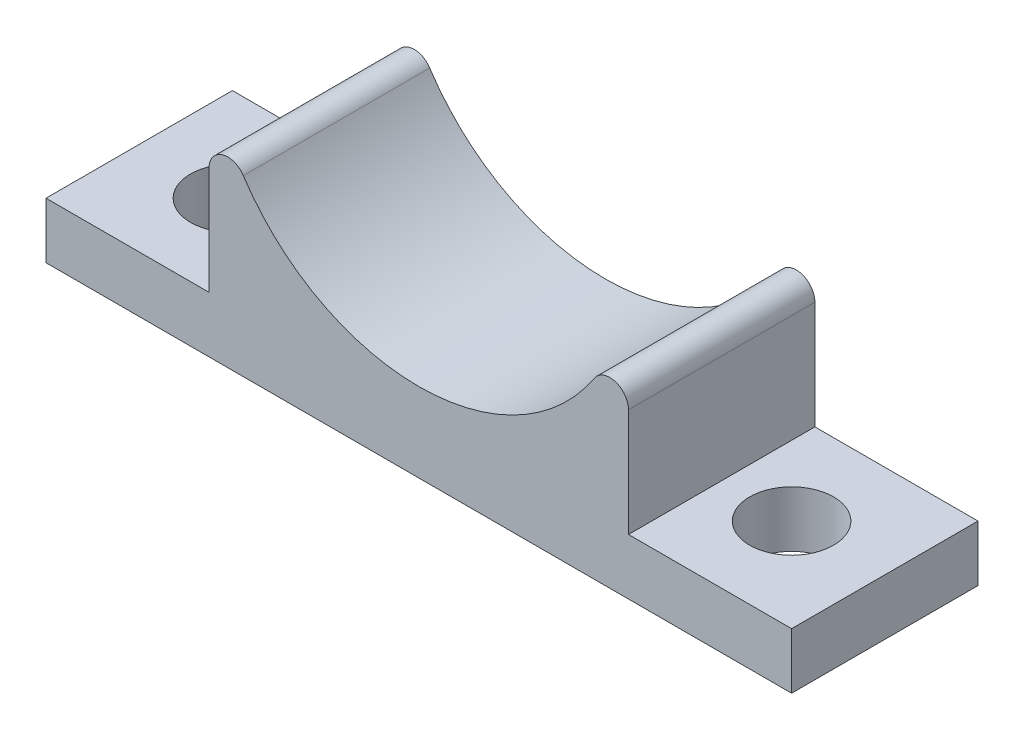
ISO-10303-21;
HEADER;
FILE_DESCRIPTION(('STEP AP214'),'2;1');
FILE_NAME('part.step','',(''),(''),'','','');
FILE_SCHEMA(('AUTOMOTIVE_DESIGN { 1 0 10303 214 1 1 1 1 }'));
ENDSEC;
DATA;
#1=APPLICATION_CONTEXT('core data for automotive mechanical design processes');
#2=APPLICATION_PROTOCOL_DEFINITION('international standard','automotive_design',2000,#1);
#3=PRODUCT_CONTEXT('',#1,'mechanical');
#4=PRODUCT('Part','Part','',(#3));
#5=PRODUCT_RELATED_PRODUCT_CATEGORY('part','',(#4));
#6=PRODUCT_DEFINITION_FORMATION('','',#4);
#7=PRODUCT_DEFINITION_CONTEXT('part definition',#1,'design');
#8=PRODUCT_DEFINITION('design','',#6,#7);
#9=PRODUCT_DEFINITION_SHAPE('','',#8);
#10=(LENGTH_UNIT() NAMED_UNIT(*) SI_UNIT(.MILLI.,.METRE.));
#11=(NAMED_UNIT(*) PLANE_ANGLE_UNIT() SI_UNIT($,.RADIAN.));
#12=(NAMED_UNIT(*) SI_UNIT($,.STERADIAN.) SOLID_ANGLE_UNIT());
#13=UNCERTAINTY_MEASURE_WITH_UNIT(LENGTH_MEASURE(1.E-05),#10,'distance_accuracy_value','');
#14=(GEOMETRIC_REPRESENTATION_CONTEXT(3) GLOBAL_UNCERTAINTY_ASSIGNED_CONTEXT((#13)) GLOBAL_UNIT_ASSIGNED_CONTEXT((#10,
#11,#12)) REPRESENTATION_CONTEXT('',''));
#15=CARTESIAN_POINT('',(0.,0.,0.));
#16=DIRECTION('',(0.,0.,1.));
#17=DIRECTION('',(1.,0.,0.));
#18=AXIS2_PLACEMENT_3D('',#15,#16,#17);
#19=CARTESIAN_POINT('',(0.,3.,0.));
#20=DIRECTION('',(0.,-1.,0.));
#21=DIRECTION('',(0.,0.,-1.));
#22=AXIS2_PLACEMENT_3D('',#19,#20,#21);
#23=PLANE('',#22);
#24=CARTESIAN_POINT('',(15.,3.,0.));
#25=DIRECTION('',(0.,-1.,0.));
#26=DIRECTION('',(0.,0.,-1.));
#27=AXIS2_PLACEMENT_3D('',#24,#25,#26);
#28=CIRCLE('',#27,2.25);
#29=CARTESIAN_POINT('',(15.,3.,-2.25));
#30=VERTEX_POINT('',#29);
#31=EDGE_CURVE('E339',#30,#30,#28,.T.);
#32=ORIENTED_EDGE('',*,*,#31,.T.);
#33=EDGE_LOOP('',(#32));
#34=FACE_BOUND('',#33,.T.);
#35=DIRECTION('',(0.,0.,-1.));
#36=VECTOR('',#35,1.);
#37=CARTESIAN_POINT('',(11.25,3.,5.));
#38=LINE('',#37,#36);
#39=CARTESIAN_POINT('',(11.25,3.,5.));
#40=VERTEX_POINT('',#39);
#41=CARTESIAN_POINT('',(11.25,3.,-5.));
#42=VERTEX_POINT('',#41);
#43=EDGE_CURVE('E114',#40,#42,#38,.T.);
#44=ORIENTED_EDGE('',*,*,#43,.F.);
#45=DIRECTION('',(1.,0.,0.));
#46=VECTOR('',#45,1.);
#47=CARTESIAN_POINT('',(-20.,3.,5.));
#48=LINE('',#47,#46);
#49=CARTESIAN_POINT('',(20.,3.,5.));
#50=VERTEX_POINT('',#49);
#51=EDGE_CURVE('E150',#40,#50,#48,.T.);
#52=ORIENTED_EDGE('',*,*,#51,.T.);
#53=DIRECTION('',(0.,0.,-1.));
#54=VECTOR('',#53,1.);
#55=CARTESIAN_POINT('',(20.,3.,5.));
#56=LINE('',#55,#54);
#57=CARTESIAN_POINT('',(20.,3.,-5.));
#58=VERTEX_POINT('',#57);
#59=EDGE_CURVE('E117',#50,#58,#56,.T.);
#60=ORIENTED_EDGE('',*,*,#59,.T.);
#61=DIRECTION('',(-1.,0.,0.));
#62=VECTOR('',#61,1.);
#63=CARTESIAN_POINT('',(-20.,3.,-5.));
#64=LINE('',#63,#62);
#65=EDGE_CURVE('E112',#58,#42,#64,.T.);
#66=ORIENTED_EDGE('',*,*,#65,.T.);
#67=EDGE_LOOP('',(#44,#52,#60,#66));
#68=FACE_BOUND('',#67,.T.);
#69=ADVANCED_FACE('F33',(#34,#68),#23,.F.);
#70=CARTESIAN_POINT('',(20.,3.,5.));
#71=DIRECTION('',(-1.,0.,0.));
#72=DIRECTION('',(0.,0.,1.));
#73=AXIS2_PLACEMENT_3D('',#70,#71,#72);
#74=PLANE('',#73);
#75=DIRECTION('',(0.,0.,-1.));
#76=VECTOR('',#75,1.);
#77=CARTESIAN_POINT('',(20.,0.,5.));
#78=LINE('',#77,#76);
#79=CARTESIAN_POINT('',(20.,0.,5.));
#80=VERTEX_POINT('',#79);
#81=CARTESIAN_POINT('',(20.,0.,-5.));
#82=VERTEX_POINT('',#81);
#83=EDGE_CURVE('E146',#80,#82,#78,.T.);
#84=ORIENTED_EDGE('',*,*,#83,.T.);
#85=DIRECTION('',(0.,-1.,0.));
#86=VECTOR('',#85,1.);
#87=CARTESIAN_POINT('',(20.,3.,-5.));
#88=LINE('',#87,#86);
#89=EDGE_CURVE('E170',#58,#82,#88,.T.);
#90=ORIENTED_EDGE('',*,*,#89,.F.);
#91=ORIENTED_EDGE('',*,*,#59,.F.);
#92=DIRECTION('',(0.,-1.,0.));
#93=VECTOR('',#92,1.);
#94=CARTESIAN_POINT('',(20.,3.,5.));
#95=LINE('',#94,#93);
#96=EDGE_CURVE('E154',#50,#80,#95,.T.);
#97=ORIENTED_EDGE('',*,*,#96,.T.);
#98=EDGE_LOOP('',(#84,#90,#91,#97));
#99=FACE_BOUND('',#98,.T.);
#100=ADVANCED_FACE('F202',(#99),#74,.F.);
#101=CARTESIAN_POINT('',(-20.,3.,-5.));
#102=DIRECTION('',(0.,0.,1.));
#103=DIRECTION('',(1.,0.,0.));
#104=AXIS2_PLACEMENT_3D('',#101,#102,#103);
#105=PLANE('',#104);
#106=CARTESIAN_POINT('',(0.,15.5,-5.));
#107=DIRECTION('',(0.,0.,-1.));
#108=DIRECTION('',(1.,0.,0.));
#109=AXIS2_PLACEMENT_3D('',#106,#107,#108);
#110=CIRCLE('',#109,11.25);
#111=CARTESIAN_POINT('',(9.41326530612245,9.33940455178629,-5.));
#112=VERTEX_POINT('',#111);
#113=CARTESIAN_POINT('',(-9.41326530612245,9.33940455178629,-5.));
#114=VERTEX_POINT('',#113);
#115=EDGE_CURVE('E138',#112,#114,#110,.T.);
#116=ORIENTED_EDGE('',*,*,#115,.F.);
#117=CARTESIAN_POINT('',(10.25,8.79179606750063,-5.));
#118=DIRECTION('',(0.,0.,1.));
#119=DIRECTION('',(1.,0.,0.));
#120=AXIS2_PLACEMENT_3D('',#117,#118,#119);
#121=CIRCLE('',#120,1.);
#122=CARTESIAN_POINT('',(11.25,8.79179606750063,-5.));
#123=VERTEX_POINT('',#122);
#124=EDGE_CURVE('E132',#112,#123,#121,.F.);
#125=ORIENTED_EDGE('',*,*,#124,.T.);
#126=DIRECTION('',(0.,1.,0.));
#127=VECTOR('',#126,1.);
#128=CARTESIAN_POINT('',(11.25,15.5,-5.));
#129=LINE('',#128,#127);
#130=EDGE_CURVE('E126',#42,#123,#129,.T.);
#131=ORIENTED_EDGE('',*,*,#130,.F.);
#132=ORIENTED_EDGE('',*,*,#65,.F.);
#133=ORIENTED_EDGE('',*,*,#89,.T.);
#134=DIRECTION('',(-1.,0.,0.));
#135=VECTOR('',#134,1.);
#136=CARTESIAN_POINT('',(-20.,0.,-5.));
#137=LINE('',#136,#135);
#138=CARTESIAN_POINT('',(-20.,0.,-5.));
#139=VERTEX_POINT('',#138);
#140=EDGE_CURVE('E157',#82,#139,#137,.T.);
#141=ORIENTED_EDGE('',*,*,#140,.T.);
#142=DIRECTION('',(0.,-1.,0.));
#143=VECTOR('',#142,1.);
#144=CARTESIAN_POINT('',(-20.,3.,-5.));
#145=LINE('',#144,#143);
#146=CARTESIAN_POINT('',(-20.,3.,-5.));
#147=VERTEX_POINT('',#146);
#148=EDGE_CURVE('E167',#147,#139,#145,.T.);
#149=ORIENTED_EDGE('',*,*,#148,.F.);
#150=CARTESIAN_POINT('',(-11.25,3.,-5.));
#151=VERTEX_POINT('',#150);
#152=EDGE_CURVE('E123',#151,#147,#64,.T.);
#153=ORIENTED_EDGE('',*,*,#152,.F.);
#154=DIRECTION('',(0.,-1.,0.));
#155=VECTOR('',#154,1.);
#156=CARTESIAN_POINT('',(-11.25,15.5,-5.));
#157=LINE('',#156,#155);
#158=CARTESIAN_POINT('',(-11.25,8.79179606750063,-5.));
#159=VERTEX_POINT('',#158);
#160=EDGE_CURVE('E134',#159,#151,#157,.T.);
#161=ORIENTED_EDGE('',*,*,#160,.F.);
#162=CARTESIAN_POINT('',(-10.25,8.79179606750063,-5.));
#163=DIRECTION('',(0.,0.,1.));
#164=DIRECTION('',(1.,0.,0.));
#165=AXIS2_PLACEMENT_3D('',#162,#163,#164);
#166=CIRCLE('',#165,1.);
#167=EDGE_CURVE('E177',#159,#114,#166,.F.);
#168=ORIENTED_EDGE('',*,*,#167,.T.);
#169=EDGE_LOOP('',(#116,#125,#131,#132,#133,#141,#149,#153,#161,#168));
#170=FACE_BOUND('',#169,.T.);
#171=ADVANCED_FACE('F131',(#170),#105,.F.);
#172=CARTESIAN_POINT('',(-20.,3.,5.));
#173=DIRECTION('',(1.,0.,0.));
#174=DIRECTION('',(0.,0.,-1.));
#175=AXIS2_PLACEMENT_3D('',#172,#173,#174);
#176=PLANE('',#175);
#177=DIRECTION('',(0.,0.,1.));
#178=VECTOR('',#177,1.);
#179=CARTESIAN_POINT('',(-20.,0.,5.));
#180=LINE('',#179,#178);
#181=CARTESIAN_POINT('',(-20.,0.,5.));
#182=VERTEX_POINT('',#181);
#183=EDGE_CURVE('E159',#139,#182,#180,.T.);
#184=ORIENTED_EDGE('',*,*,#183,.T.);
#185=DIRECTION('',(0.,-1.,0.));
#186=VECTOR('',#185,1.);
#187=CARTESIAN_POINT('',(-20.,3.,5.));
#188=LINE('',#187,#186);
#189=CARTESIAN_POINT('',(-20.,3.,5.));
#190=VERTEX_POINT('',#189);
#191=EDGE_CURVE('E164',#190,#182,#188,.T.);
#192=ORIENTED_EDGE('',*,*,#191,.F.);
#193=DIRECTION('',(0.,0.,1.));
#194=VECTOR('',#193,1.);
#195=CARTESIAN_POINT('',(-20.,3.,5.));
#196=LINE('',#195,#194);
#197=EDGE_CURVE('E122',#147,#190,#196,.T.);
#198=ORIENTED_EDGE('',*,*,#197,.F.);
#199=ORIENTED_EDGE('',*,*,#148,.T.);
#200=EDGE_LOOP('',(#184,#192,#198,#199));
#201=FACE_BOUND('',#200,.T.);
#202=ADVANCED_FACE('F221',(#201),#176,.F.);
#203=CARTESIAN_POINT('',(-20.,3.,5.));
#204=DIRECTION('',(0.,0.,-1.));
#205=DIRECTION('',(-1.,0.,0.));
#206=AXIS2_PLACEMENT_3D('',#203,#204,#205);
#207=PLANE('',#206);
#208=DIRECTION('',(0.,1.,0.));
#209=VECTOR('',#208,1.);
#210=CARTESIAN_POINT('',(11.25,15.5,5.));
#211=LINE('',#210,#209);
#212=CARTESIAN_POINT('',(11.25,8.79179606750063,5.));
#213=VERTEX_POINT('',#212);
#214=EDGE_CURVE('E127',#40,#213,#211,.T.);
#215=ORIENTED_EDGE('',*,*,#214,.T.);
#216=CARTESIAN_POINT('',(10.25,8.79179606750063,5.));
#217=DIRECTION('',(0.,0.,-1.));
#218=DIRECTION('',(-1.,0.,0.));
#219=AXIS2_PLACEMENT_3D('',#216,#217,#218);
#220=CIRCLE('',#219,1.);
#221=CARTESIAN_POINT('',(9.41326530612245,9.33940455178629,5.));
#222=VERTEX_POINT('',#221);
#223=EDGE_CURVE('E41',#213,#222,#220,.F.);
#224=ORIENTED_EDGE('',*,*,#223,.T.);
#225=CARTESIAN_POINT('',(0.,15.5,5.));
#226=DIRECTION('',(0.,0.,-1.));
#227=DIRECTION('',(1.,0.,0.));
#228=AXIS2_PLACEMENT_3D('',#225,#226,#227);
#229=CIRCLE('',#228,11.25);
#230=CARTESIAN_POINT('',(-9.41326530612245,9.33940455178629,5.));
#231=VERTEX_POINT('',#230);
#232=EDGE_CURVE('E133',#222,#231,#229,.T.);
#233=ORIENTED_EDGE('',*,*,#232,.T.);
#234=CARTESIAN_POINT('',(-10.25,8.79179606750063,5.));
#235=DIRECTION('',(0.,0.,-1.));
#236=DIRECTION('',(-1.,0.,0.));
#237=AXIS2_PLACEMENT_3D('',#234,#235,#236);
#238=CIRCLE('',#237,1.);
#239=CARTESIAN_POINT('',(-11.25,8.79179606750063,5.));
#240=VERTEX_POINT('',#239);
#241=EDGE_CURVE('E48',#231,#240,#238,.F.);
#242=ORIENTED_EDGE('',*,*,#241,.T.);
#243=DIRECTION('',(0.,-1.,0.));
#244=VECTOR('',#243,1.);
#245=CARTESIAN_POINT('',(-11.25,15.5,5.));
#246=LINE('',#245,#244);
#247=CARTESIAN_POINT('',(-11.25,3.,5.));
#248=VERTEX_POINT('',#247);
#249=EDGE_CURVE('E136',#240,#248,#246,.T.);
#250=ORIENTED_EDGE('',*,*,#249,.T.);
#251=EDGE_CURVE('E151',#190,#248,#48,.T.);
#252=ORIENTED_EDGE('',*,*,#251,.F.);
#253=ORIENTED_EDGE('',*,*,#191,.T.);
#254=DIRECTION('',(1.,0.,0.));
#255=VECTOR('',#254,1.);
#256=CARTESIAN_POINT('',(-20.,0.,5.));
#257=LINE('',#256,#255);
#258=EDGE_CURVE('E147',#182,#80,#257,.T.);
#259=ORIENTED_EDGE('',*,*,#258,.T.);
#260=ORIENTED_EDGE('',*,*,#96,.F.);
#261=ORIENTED_EDGE('',*,*,#51,.F.);
#262=EDGE_LOOP('',(#215,#224,#233,#242,#250,#252,#253,#259,#260,#261));
#263=FACE_BOUND('',#262,.T.);
#264=ADVANCED_FACE('F183',(#263),#207,.F.);
#265=CARTESIAN_POINT('',(-15.,3.,0.));
#266=DIRECTION('',(0.,-1.,0.));
#267=DIRECTION('',(0.,0.,-1.));
#268=AXIS2_PLACEMENT_3D('',#265,#266,#267);
#269=CIRCLE('',#268,2.25);
#270=CARTESIAN_POINT('',(-15.,3.,-2.25));
#271=VERTEX_POINT('',#270);
#272=EDGE_CURVE('E226',#271,#271,#269,.T.);
#273=ORIENTED_EDGE('',*,*,#272,.T.);
#274=EDGE_LOOP('',(#273));
#275=FACE_BOUND('',#274,.T.);
#276=ORIENTED_EDGE('',*,*,#251,.T.);
#277=DIRECTION('',(0.,0.,-1.));
#278=VECTOR('',#277,1.);
#279=CARTESIAN_POINT('',(-11.25,3.,5.));
#280=LINE('',#279,#278);
#281=EDGE_CURVE('E128',#248,#151,#280,.T.);
#282=ORIENTED_EDGE('',*,*,#281,.T.);
#283=ORIENTED_EDGE('',*,*,#152,.T.);
#284=ORIENTED_EDGE('',*,*,#197,.T.);
#285=EDGE_LOOP('',(#276,#282,#283,#284));
#286=FACE_BOUND('',#285,.T.);
#287=ADVANCED_FACE('F205',(#275,#286),#23,.F.);
#288=CARTESIAN_POINT('',(0.,0.,0.));
#289=DIRECTION('',(0.,-1.,0.));
#290=DIRECTION('',(0.,0.,-1.));
#291=AXIS2_PLACEMENT_3D('',#288,#289,#290);
#292=PLANE('',#291);
#293=CARTESIAN_POINT('',(-15.,0.,0.));
#294=DIRECTION('',(0.,-1.,0.));
#295=DIRECTION('',(0.,0.,-1.));
#296=AXIS2_PLACEMENT_3D('',#293,#294,#295);
#297=CIRCLE('',#296,2.25);
#298=CARTESIAN_POINT('',(-15.,0.,-2.25));
#299=VERTEX_POINT('',#298);
#300=EDGE_CURVE('E335',#299,#299,#297,.T.);
#301=ORIENTED_EDGE('',*,*,#300,.F.);
#302=EDGE_LOOP('',(#301));
#303=FACE_BOUND('',#302,.T.);
#304=CARTESIAN_POINT('',(15.,0.,0.));
#305=DIRECTION('',(0.,-1.,0.));
#306=DIRECTION('',(0.,0.,-1.));
#307=AXIS2_PLACEMENT_3D('',#304,#305,#306);
#308=CIRCLE('',#307,2.25);
#309=CARTESIAN_POINT('',(15.,0.,-2.25));
#310=VERTEX_POINT('',#309);
#311=EDGE_CURVE('E336',#310,#310,#308,.T.);
#312=ORIENTED_EDGE('',*,*,#311,.F.);
#313=EDGE_LOOP('',(#312));
#314=FACE_BOUND('',#313,.T.);
#315=ORIENTED_EDGE('',*,*,#83,.F.);
#316=ORIENTED_EDGE('',*,*,#258,.F.);
#317=ORIENTED_EDGE('',*,*,#183,.F.);
#318=ORIENTED_EDGE('',*,*,#140,.F.);
#319=EDGE_LOOP('',(#315,#316,#317,#318));
#320=FACE_BOUND('',#319,.T.);
#321=ADVANCED_FACE('F214',(#303,#314,#320),#292,.T.);
#322=CARTESIAN_POINT('',(0.,15.5,5.));
#323=DIRECTION('',(0.,0.,-1.));
#324=DIRECTION('',(-1.,0.,0.));
#325=AXIS2_PLACEMENT_3D('',#322,#323,#324);
#326=CYLINDRICAL_SURFACE('',#325,11.25);
#327=ORIENTED_EDGE('',*,*,#232,.F.);
#328=DIRECTION('',(0.,0.,-1.));
#329=VECTOR('',#328,1.);
#330=CARTESIAN_POINT('',(9.41326530612245,9.33940455178629,5.));
#331=LINE('',#330,#329);
#332=EDGE_CURVE('E174',#222,#112,#331,.T.);
#333=ORIENTED_EDGE('',*,*,#332,.T.);
#334=ORIENTED_EDGE('',*,*,#115,.T.);
#335=DIRECTION('',(0.,0.,-1.));
#336=VECTOR('',#335,1.);
#337=CARTESIAN_POINT('',(-9.41326530612245,9.33940455178629,5.));
#338=LINE('',#337,#336);
#339=EDGE_CURVE('E172',#114,#231,#338,.F.);
#340=ORIENTED_EDGE('',*,*,#339,.T.);
#341=EDGE_LOOP('',(#327,#333,#334,#340));
#342=FACE_BOUND('',#341,.T.);
#343=ADVANCED_FACE('F187',(#342),#326,.F.);
#344=CARTESIAN_POINT('',(-11.25,15.5,5.));
#345=DIRECTION('',(1.,0.,0.));
#346=DIRECTION('',(0.,0.,-1.));
#347=AXIS2_PLACEMENT_3D('',#344,#345,#346);
#348=PLANE('',#347);
#349=ORIENTED_EDGE('',*,*,#249,.F.);
#350=DIRECTION('',(0.,0.,-1.));
#351=VECTOR('',#350,1.);
#352=CARTESIAN_POINT('',(-11.25,8.79179606750063,5.));
#353=LINE('',#352,#351);
#354=EDGE_CURVE('E11',#240,#159,#353,.T.);
#355=ORIENTED_EDGE('',*,*,#354,.T.);
#356=ORIENTED_EDGE('',*,*,#160,.T.);
#357=ORIENTED_EDGE('',*,*,#281,.F.);
#358=EDGE_LOOP('',(#349,#355,#356,#357));
#359=FACE_BOUND('',#358,.T.);
#360=ADVANCED_FACE('F198',(#359),#348,.F.);
#361=CARTESIAN_POINT('',(11.25,15.5,5.));
#362=DIRECTION('',(-1.,0.,0.));
#363=DIRECTION('',(0.,-1.,0.));
#364=AXIS2_PLACEMENT_3D('',#361,#362,#363);
#365=PLANE('',#364);
#366=ORIENTED_EDGE('',*,*,#130,.T.);
#367=DIRECTION('',(0.,0.,-1.));
#368=VECTOR('',#367,1.);
#369=CARTESIAN_POINT('',(11.25,8.79179606750063,5.));
#370=LINE('',#369,#368);
#371=EDGE_CURVE('E56',#123,#213,#370,.F.);
#372=ORIENTED_EDGE('',*,*,#371,.T.);
#373=ORIENTED_EDGE('',*,*,#214,.F.);
#374=ORIENTED_EDGE('',*,*,#43,.T.);
#375=EDGE_LOOP('',(#366,#372,#373,#374));
#376=FACE_BOUND('',#375,.T.);
#377=ADVANCED_FACE('F125',(#376),#365,.F.);
#378=CARTESIAN_POINT('',(10.25,8.79179606750063,5.));
#379=DIRECTION('',(0.,0.,-1.));
#380=DIRECTION('',(-1.,0.,0.));
#381=AXIS2_PLACEMENT_3D('',#378,#379,#380);
#382=CYLINDRICAL_SURFACE('',#381,1.);
#383=ORIENTED_EDGE('',*,*,#223,.F.);
#384=ORIENTED_EDGE('',*,*,#371,.F.);
#385=ORIENTED_EDGE('',*,*,#124,.F.);
#386=ORIENTED_EDGE('',*,*,#332,.F.);
#387=EDGE_LOOP('',(#383,#384,#385,#386));
#388=FACE_BOUND('',#387,.T.);
#389=ADVANCED_FACE('F190',(#388),#382,.T.);
#390=CARTESIAN_POINT('',(-10.25,8.79179606750063,5.));
#391=DIRECTION('',(0.,0.,-1.));
#392=DIRECTION('',(-1.,0.,0.));
#393=AXIS2_PLACEMENT_3D('',#390,#391,#392);
#394=CYLINDRICAL_SURFACE('',#393,1.);
#395=ORIENTED_EDGE('',*,*,#241,.F.);
#396=ORIENTED_EDGE('',*,*,#339,.F.);
#397=ORIENTED_EDGE('',*,*,#167,.F.);
#398=ORIENTED_EDGE('',*,*,#354,.F.);
#399=EDGE_LOOP('',(#395,#396,#397,#398));
#400=FACE_BOUND('',#399,.T.);
#401=ADVANCED_FACE('F35',(#400),#394,.T.);
#402=CARTESIAN_POINT('',(15.,0.,0.));
#403=DIRECTION('',(0.,-1.,0.));
#404=DIRECTION('',(0.,0.,-1.));
#405=AXIS2_PLACEMENT_3D('',#402,#403,#404);
#406=CYLINDRICAL_SURFACE('',#405,2.25);
#407=ORIENTED_EDGE('',*,*,#311,.T.);
#408=EDGE_LOOP('',(#407));
#409=FACE_BOUND('',#408,.T.);
#410=ORIENTED_EDGE('',*,*,#31,.F.);
#411=EDGE_LOOP('',(#410));
#412=FACE_BOUND('',#411,.T.);
#413=ADVANCED_FACE('F196',(#409,#412),#406,.F.);
#414=CARTESIAN_POINT('',(-15.,0.,0.));
#415=DIRECTION('',(0.,-1.,0.));
#416=DIRECTION('',(0.,0.,-1.));
#417=AXIS2_PLACEMENT_3D('',#414,#415,#416);
#418=CYLINDRICAL_SURFACE('',#417,2.25);
#419=ORIENTED_EDGE('',*,*,#300,.T.);
#420=EDGE_LOOP('',(#419));
#421=FACE_BOUND('',#420,.T.);
#422=ORIENTED_EDGE('',*,*,#272,.F.);
#423=EDGE_LOOP('',(#422));
#424=FACE_BOUND('',#423,.T.);
#425=ADVANCED_FACE('F326',(#421,#424),#418,.F.);
#426=CLOSED_SHELL('',(#69,#100,#171,#202,#264,#287,#321,#343,#360,#377,#389,#401,#413,#425));
#427=MANIFOLD_SOLID_BREP('B2',#426);
#428=ADVANCED_BREP_SHAPE_REPRESENTATION('',(#18,#427),#14);
#429=SHAPE_DEFINITION_REPRESENTATION(#9,#428);
ENDSEC;
END-ISO-10303-21;
